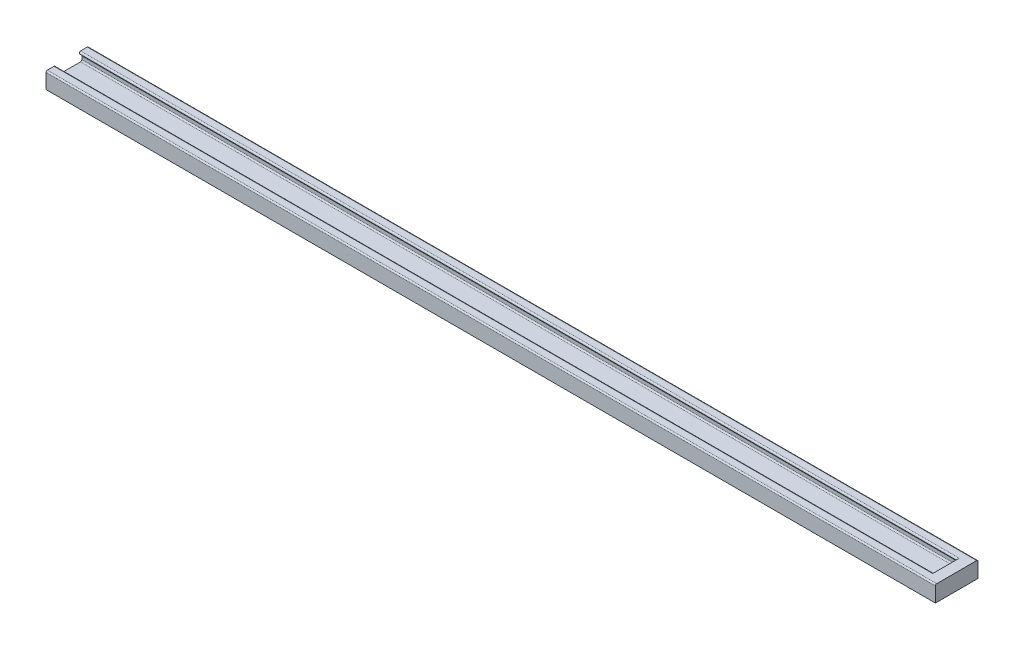
ISO-10303-21;
HEADER;
FILE_DESCRIPTION(('STEP AP214'),'2;1');
FILE_NAME('part.step','',(''),(''),'','','');
FILE_SCHEMA(('AUTOMOTIVE_DESIGN { 1 0 10303 214 1 1 1 1 }'));
ENDSEC;
DATA;
#1=APPLICATION_CONTEXT('core data for automotive mechanical design processes');
#2=APPLICATION_PROTOCOL_DEFINITION('international standard','automotive_design',2000,#1);
#3=PRODUCT_CONTEXT('',#1,'mechanical');
#4=PRODUCT('Part','Part','',(#3));
#5=PRODUCT_RELATED_PRODUCT_CATEGORY('part','',(#4));
#6=PRODUCT_DEFINITION_FORMATION('','',#4);
#7=PRODUCT_DEFINITION_CONTEXT('part definition',#1,'design');
#8=PRODUCT_DEFINITION('design','',#6,#7);
#9=PRODUCT_DEFINITION_SHAPE('','',#8);
#10=(LENGTH_UNIT() NAMED_UNIT(*) SI_UNIT(.MILLI.,.METRE.));
#11=(NAMED_UNIT(*) PLANE_ANGLE_UNIT() SI_UNIT($,.RADIAN.));
#12=(NAMED_UNIT(*) SI_UNIT($,.STERADIAN.) SOLID_ANGLE_UNIT());
#13=UNCERTAINTY_MEASURE_WITH_UNIT(LENGTH_MEASURE(1.E-05),#10,'distance_accuracy_value','');
#14=(GEOMETRIC_REPRESENTATION_CONTEXT(3) GLOBAL_UNCERTAINTY_ASSIGNED_CONTEXT((#13)) GLOBAL_UNIT_ASSIGNED_CONTEXT((#10,
#11,#12)) REPRESENTATION_CONTEXT('',''));
#15=CARTESIAN_POINT('',(0.,0.,0.));
#16=DIRECTION('',(0.,0.,1.));
#17=DIRECTION('',(1.,0.,0.));
#18=AXIS2_PLACEMENT_3D('',#15,#16,#17);
#19=CARTESIAN_POINT('',(330.,5.5,-4.95710678118656));
#20=DIRECTION('',(-1.,0.,0.));
#21=DIRECTION('',(0.,0.,1.));
#22=AXIS2_PLACEMENT_3D('',#19,#20,#21);
#23=CYLINDRICAL_SURFACE('',#22,0.499999999999999);
#24=CARTESIAN_POINT('',(326.,5.5,-4.95710678118656));
#25=DIRECTION('',(1.,0.,0.));
#26=DIRECTION('',(0.,0.,-1.));
#27=AXIS2_PLACEMENT_3D('',#24,#25,#26);
#28=CIRCLE('',#27,0.499999999999999);
#29=CARTESIAN_POINT('',(326.,6.,-4.95710678118656));
#30=VERTEX_POINT('',#29);
#31=CARTESIAN_POINT('',(326.,5.14644660940673,-4.60355339059328));
#32=VERTEX_POINT('',#31);
#33=EDGE_CURVE('E160',#30,#32,#28,.T.);
#34=ORIENTED_EDGE('',*,*,#33,.F.);
#35=DIRECTION('',(-1.,0.,0.));
#36=VECTOR('',#35,1.);
#37=CARTESIAN_POINT('',(330.,6.,-4.95710678118656));
#38=LINE('',#37,#36);
#39=CARTESIAN_POINT('',(0.,6.,-4.95710678118656));
#40=VERTEX_POINT('',#39);
#41=EDGE_CURVE('E150',#30,#40,#38,.T.);
#42=ORIENTED_EDGE('',*,*,#41,.T.);
#43=CARTESIAN_POINT('',(0.,5.5,-4.95710678118656));
#44=DIRECTION('',(1.,0.,0.));
#45=DIRECTION('',(0.,0.,-1.));
#46=AXIS2_PLACEMENT_3D('',#43,#44,#45);
#47=CIRCLE('',#46,0.499999999999999);
#48=CARTESIAN_POINT('',(0.,5.14644660940673,-4.60355339059328));
#49=VERTEX_POINT('',#48);
#50=EDGE_CURVE('E169',#40,#49,#47,.T.);
#51=ORIENTED_EDGE('',*,*,#50,.T.);
#52=DIRECTION('',(-1.,0.,0.));
#53=VECTOR('',#52,1.);
#54=CARTESIAN_POINT('',(330.,5.14644660940673,-4.60355339059328));
#55=LINE('',#54,#53);
#56=EDGE_CURVE('E229',#32,#49,#55,.T.);
#57=ORIENTED_EDGE('',*,*,#56,.F.);
#58=EDGE_LOOP('',(#34,#42,#51,#57));
#59=FACE_BOUND('',#58,.T.);
#60=ADVANCED_FACE('F33',(#59),#23,.T.);
#61=CARTESIAN_POINT('',(330.,4.49644660940672,-5.25355339059328));
#62=DIRECTION('',(0.,0.707106781186543,-0.707106781186552));
#63=DIRECTION('',(0.,0.707106781186552,0.707106781186543));
#64=AXIS2_PLACEMENT_3D('',#61,#62,#63);
#65=PLANE('',#64);
#66=DIRECTION('',(0.,-0.707106781186552,-0.707106781186543));
#67=VECTOR('',#66,1.);
#68=CARTESIAN_POINT('',(326.,4.49644660940672,-5.25355339059328));
#69=LINE('',#68,#67);
#70=CARTESIAN_POINT('',(326.,4.49644660940672,-5.25355339059328));
#71=VERTEX_POINT('',#70);
#72=EDGE_CURVE('E258',#32,#71,#69,.T.);
#73=ORIENTED_EDGE('',*,*,#72,.F.);
#74=ORIENTED_EDGE('',*,*,#56,.T.);
#75=DIRECTION('',(0.,-0.707106781186552,-0.707106781186543));
#76=VECTOR('',#75,1.);
#77=CARTESIAN_POINT('',(0.,4.49644660940672,-5.25355339059328));
#78=LINE('',#77,#76);
#79=CARTESIAN_POINT('',(0.,4.49644660940672,-5.25355339059328));
#80=VERTEX_POINT('',#79);
#81=EDGE_CURVE('E172',#49,#80,#78,.T.);
#82=ORIENTED_EDGE('',*,*,#81,.T.);
#83=DIRECTION('',(-1.,0.,0.));
#84=VECTOR('',#83,1.);
#85=CARTESIAN_POINT('',(330.,4.49644660940672,-5.25355339059328));
#86=LINE('',#85,#84);
#87=EDGE_CURVE('E227',#71,#80,#86,.T.);
#88=ORIENTED_EDGE('',*,*,#87,.F.);
#89=EDGE_LOOP('',(#73,#74,#82,#88));
#90=FACE_BOUND('',#89,.T.);
#91=ADVANCED_FACE('F279',(#90),#65,.F.);
#92=CARTESIAN_POINT('',(330.,4.14289321881345,-4.9));
#93=DIRECTION('',(-1.,0.,0.));
#94=DIRECTION('',(0.,0.,1.));
#95=AXIS2_PLACEMENT_3D('',#92,#93,#94);
#96=CYLINDRICAL_SURFACE('',#95,0.500000000000001);
#97=CARTESIAN_POINT('',(326.,4.14289321881345,-4.9));
#98=DIRECTION('',(1.,0.,0.));
#99=DIRECTION('',(0.,0.,-1.));
#100=AXIS2_PLACEMENT_3D('',#97,#98,#99);
#101=CIRCLE('',#100,0.500000000000001);
#102=CARTESIAN_POINT('',(326.,4.14289321881345,-5.4));
#103=VERTEX_POINT('',#102);
#104=EDGE_CURVE('E260',#71,#103,#101,.F.);
#105=ORIENTED_EDGE('',*,*,#104,.F.);
#106=ORIENTED_EDGE('',*,*,#87,.T.);
#107=CARTESIAN_POINT('',(0.,4.14289321881345,-4.9));
#108=DIRECTION('',(-1.,0.,0.));
#109=DIRECTION('',(0.,0.,-1.));
#110=AXIS2_PLACEMENT_3D('',#107,#108,#109);
#111=CIRCLE('',#110,0.500000000000001);
#112=CARTESIAN_POINT('',(0.,4.14289321881345,-5.4));
#113=VERTEX_POINT('',#112);
#114=EDGE_CURVE('E175',#80,#113,#111,.T.);
#115=ORIENTED_EDGE('',*,*,#114,.T.);
#116=DIRECTION('',(-1.,0.,0.));
#117=VECTOR('',#116,1.);
#118=CARTESIAN_POINT('',(330.,4.14289321881345,-5.4));
#119=LINE('',#118,#117);
#120=EDGE_CURVE('E225',#103,#113,#119,.T.);
#121=ORIENTED_EDGE('',*,*,#120,.F.);
#122=EDGE_LOOP('',(#105,#106,#115,#121));
#123=FACE_BOUND('',#122,.T.);
#124=ADVANCED_FACE('F284',(#123),#96,.F.);
#125=CARTESIAN_POINT('',(330.,3.,-5.4));
#126=DIRECTION('',(0.,0.,-1.));
#127=DIRECTION('',(0.,1.,0.));
#128=AXIS2_PLACEMENT_3D('',#125,#126,#127);
#129=PLANE('',#128);
#130=DIRECTION('',(0.,-1.,0.));
#131=VECTOR('',#130,1.);
#132=CARTESIAN_POINT('',(326.,3.,-5.4));
#133=LINE('',#132,#131);
#134=CARTESIAN_POINT('',(326.,3.,-5.4));
#135=VERTEX_POINT('',#134);
#136=EDGE_CURVE('E345',#103,#135,#133,.T.);
#137=ORIENTED_EDGE('',*,*,#136,.F.);
#138=ORIENTED_EDGE('',*,*,#120,.T.);
#139=DIRECTION('',(0.,-1.,0.));
#140=VECTOR('',#139,1.);
#141=CARTESIAN_POINT('',(0.,3.,-5.4));
#142=LINE('',#141,#140);
#143=CARTESIAN_POINT('',(0.,3.,-5.4));
#144=VERTEX_POINT('',#143);
#145=EDGE_CURVE('E178',#113,#144,#142,.T.);
#146=ORIENTED_EDGE('',*,*,#145,.T.);
#147=DIRECTION('',(-1.,0.,0.));
#148=VECTOR('',#147,1.);
#149=CARTESIAN_POINT('',(330.,3.,-5.4));
#150=LINE('',#149,#148);
#151=EDGE_CURVE('E223',#135,#144,#150,.T.);
#152=ORIENTED_EDGE('',*,*,#151,.F.);
#153=EDGE_LOOP('',(#137,#138,#146,#152));
#154=FACE_BOUND('',#153,.T.);
#155=ADVANCED_FACE('F329',(#154),#129,.F.);
#156=CARTESIAN_POINT('',(330.,3.,-4.9));
#157=DIRECTION('',(-1.,0.,0.));
#158=DIRECTION('',(0.,0.,1.));
#159=AXIS2_PLACEMENT_3D('',#156,#157,#158);
#160=CYLINDRICAL_SURFACE('',#159,0.5);
#161=CARTESIAN_POINT('',(326.,3.,-4.9));
#162=DIRECTION('',(1.,0.,0.));
#163=DIRECTION('',(0.,0.,-1.));
#164=AXIS2_PLACEMENT_3D('',#161,#162,#163);
#165=CIRCLE('',#164,0.5);
#166=CARTESIAN_POINT('',(326.,2.5,-4.9));
#167=VERTEX_POINT('',#166);
#168=EDGE_CURVE('E355',#135,#167,#165,.F.);
#169=ORIENTED_EDGE('',*,*,#168,.F.);
#170=ORIENTED_EDGE('',*,*,#151,.T.);
#171=CARTESIAN_POINT('',(0.,3.,-4.9));
#172=DIRECTION('',(-1.,0.,0.));
#173=DIRECTION('',(0.,0.,-1.));
#174=AXIS2_PLACEMENT_3D('',#171,#172,#173);
#175=CIRCLE('',#174,0.5);
#176=CARTESIAN_POINT('',(0.,2.5,-4.9));
#177=VERTEX_POINT('',#176);
#178=EDGE_CURVE('E181',#144,#177,#175,.T.);
#179=ORIENTED_EDGE('',*,*,#178,.T.);
#180=DIRECTION('',(-1.,0.,0.));
#181=VECTOR('',#180,1.);
#182=CARTESIAN_POINT('',(330.,2.5,-4.9));
#183=LINE('',#182,#181);
#184=EDGE_CURVE('E221',#167,#177,#183,.T.);
#185=ORIENTED_EDGE('',*,*,#184,.F.);
#186=EDGE_LOOP('',(#169,#170,#179,#185));
#187=FACE_BOUND('',#186,.T.);
#188=ADVANCED_FACE('F325',(#187),#160,.F.);
#189=CARTESIAN_POINT('',(330.,2.5,-4.9));
#190=DIRECTION('',(0.,-1.,0.));
#191=DIRECTION('',(0.,0.,-1.));
#192=AXIS2_PLACEMENT_3D('',#189,#190,#191);
#193=PLANE('',#192);
#194=DIRECTION('',(0.,0.,1.));
#195=VECTOR('',#194,1.);
#196=CARTESIAN_POINT('',(326.,2.5,-4.9));
#197=LINE('',#196,#195);
#198=CARTESIAN_POINT('',(326.,2.5,4.9));
#199=VERTEX_POINT('',#198);
#200=EDGE_CURVE('E357',#167,#199,#197,.T.);
#201=ORIENTED_EDGE('',*,*,#200,.F.);
#202=ORIENTED_EDGE('',*,*,#184,.T.);
#203=DIRECTION('',(0.,0.,1.));
#204=VECTOR('',#203,1.);
#205=CARTESIAN_POINT('',(0.,2.5,-4.9));
#206=LINE('',#205,#204);
#207=CARTESIAN_POINT('',(0.,2.5,4.9));
#208=VERTEX_POINT('',#207);
#209=EDGE_CURVE('E184',#177,#208,#206,.T.);
#210=ORIENTED_EDGE('',*,*,#209,.T.);
#211=DIRECTION('',(-1.,0.,0.));
#212=VECTOR('',#211,1.);
#213=CARTESIAN_POINT('',(330.,2.5,4.9));
#214=LINE('',#213,#212);
#215=EDGE_CURVE('E219',#199,#208,#214,.T.);
#216=ORIENTED_EDGE('',*,*,#215,.F.);
#217=EDGE_LOOP('',(#201,#202,#210,#216));
#218=FACE_BOUND('',#217,.T.);
#219=ADVANCED_FACE('F321',(#218),#193,.F.);
#220=CARTESIAN_POINT('',(330.,3.,4.9));
#221=DIRECTION('',(-1.,0.,0.));
#222=DIRECTION('',(0.,0.,1.));
#223=AXIS2_PLACEMENT_3D('',#220,#221,#222);
#224=CYLINDRICAL_SURFACE('',#223,0.5);
#225=CARTESIAN_POINT('',(326.,3.,4.9));
#226=DIRECTION('',(1.,0.,0.));
#227=DIRECTION('',(0.,0.,-1.));
#228=AXIS2_PLACEMENT_3D('',#225,#226,#227);
#229=CIRCLE('',#228,0.5);
#230=CARTESIAN_POINT('',(326.,3.,5.4));
#231=VERTEX_POINT('',#230);
#232=EDGE_CURVE('E362',#199,#231,#229,.F.);
#233=ORIENTED_EDGE('',*,*,#232,.F.);
#234=ORIENTED_EDGE('',*,*,#215,.T.);
#235=CARTESIAN_POINT('',(0.,3.,4.9));
#236=DIRECTION('',(-1.,0.,0.));
#237=DIRECTION('',(0.,0.,1.));
#238=AXIS2_PLACEMENT_3D('',#235,#236,#237);
#239=CIRCLE('',#238,0.5);
#240=CARTESIAN_POINT('',(0.,3.,5.4));
#241=VERTEX_POINT('',#240);
#242=EDGE_CURVE('E187',#208,#241,#239,.T.);
#243=ORIENTED_EDGE('',*,*,#242,.T.);
#244=DIRECTION('',(-1.,0.,0.));
#245=VECTOR('',#244,1.);
#246=CARTESIAN_POINT('',(330.,3.,5.4));
#247=LINE('',#246,#245);
#248=EDGE_CURVE('E217',#231,#241,#247,.T.);
#249=ORIENTED_EDGE('',*,*,#248,.F.);
#250=EDGE_LOOP('',(#233,#234,#243,#249));
#251=FACE_BOUND('',#250,.T.);
#252=ADVANCED_FACE('F317',(#251),#224,.F.);
#253=CARTESIAN_POINT('',(330.,3.,5.4));
#254=DIRECTION('',(0.,0.,1.));
#255=DIRECTION('',(0.,-1.,0.));
#256=AXIS2_PLACEMENT_3D('',#253,#254,#255);
#257=PLANE('',#256);
#258=DIRECTION('',(0.,1.,0.));
#259=VECTOR('',#258,1.);
#260=CARTESIAN_POINT('',(326.,3.,5.4));
#261=LINE('',#260,#259);
#262=CARTESIAN_POINT('',(326.,4.14289321881345,5.4));
#263=VERTEX_POINT('',#262);
#264=EDGE_CURVE('E365',#231,#263,#261,.T.);
#265=ORIENTED_EDGE('',*,*,#264,.F.);
#266=ORIENTED_EDGE('',*,*,#248,.T.);
#267=DIRECTION('',(0.,1.,0.));
#268=VECTOR('',#267,1.);
#269=CARTESIAN_POINT('',(0.,3.,5.4));
#270=LINE('',#269,#268);
#271=CARTESIAN_POINT('',(0.,4.14289321881345,5.4));
#272=VERTEX_POINT('',#271);
#273=EDGE_CURVE('E190',#241,#272,#270,.T.);
#274=ORIENTED_EDGE('',*,*,#273,.T.);
#275=DIRECTION('',(-1.,0.,0.));
#276=VECTOR('',#275,1.);
#277=CARTESIAN_POINT('',(330.,4.14289321881345,5.4));
#278=LINE('',#277,#276);
#279=EDGE_CURVE('E215',#263,#272,#278,.T.);
#280=ORIENTED_EDGE('',*,*,#279,.F.);
#281=EDGE_LOOP('',(#265,#266,#274,#280));
#282=FACE_BOUND('',#281,.T.);
#283=ADVANCED_FACE('F313',(#282),#257,.F.);
#284=CARTESIAN_POINT('',(330.,4.14289321881345,4.9));
#285=DIRECTION('',(-1.,0.,0.));
#286=DIRECTION('',(0.,0.,1.));
#287=AXIS2_PLACEMENT_3D('',#284,#285,#286);
#288=CYLINDRICAL_SURFACE('',#287,0.5);
#289=CARTESIAN_POINT('',(326.,4.14289321881345,4.9));
#290=DIRECTION('',(1.,0.,0.));
#291=DIRECTION('',(0.,0.,-1.));
#292=AXIS2_PLACEMENT_3D('',#289,#290,#291);
#293=CIRCLE('',#292,0.5);
#294=CARTESIAN_POINT('',(326.,4.49644660940672,5.25355339059328));
#295=VERTEX_POINT('',#294);
#296=EDGE_CURVE('E368',#263,#295,#293,.F.);
#297=ORIENTED_EDGE('',*,*,#296,.F.);
#298=ORIENTED_EDGE('',*,*,#279,.T.);
#299=CARTESIAN_POINT('',(0.,4.14289321881345,4.9));
#300=DIRECTION('',(-1.,0.,0.));
#301=DIRECTION('',(0.,0.,1.));
#302=AXIS2_PLACEMENT_3D('',#299,#300,#301);
#303=CIRCLE('',#302,0.5);
#304=CARTESIAN_POINT('',(0.,4.49644660940672,5.25355339059328));
#305=VERTEX_POINT('',#304);
#306=EDGE_CURVE('E193',#272,#305,#303,.T.);
#307=ORIENTED_EDGE('',*,*,#306,.T.);
#308=DIRECTION('',(-1.,0.,0.));
#309=VECTOR('',#308,1.);
#310=CARTESIAN_POINT('',(330.,4.49644660940672,5.25355339059328));
#311=LINE('',#310,#309);
#312=EDGE_CURVE('E213',#295,#305,#311,.T.);
#313=ORIENTED_EDGE('',*,*,#312,.F.);
#314=EDGE_LOOP('',(#297,#298,#307,#313));
#315=FACE_BOUND('',#314,.T.);
#316=ADVANCED_FACE('F306',(#315),#288,.F.);
#317=CARTESIAN_POINT('',(330.,4.49644660940672,5.25355339059328));
#318=DIRECTION('',(0.,0.707106781186543,0.707106781186552));
#319=DIRECTION('',(0.,-0.707106781186552,0.707106781186543));
#320=AXIS2_PLACEMENT_3D('',#317,#318,#319);
#321=PLANE('',#320);
#322=DIRECTION('',(0.,0.707106781186552,-0.707106781186543));
#323=VECTOR('',#322,1.);
#324=CARTESIAN_POINT('',(326.,4.49644660940672,5.25355339059328));
#325=LINE('',#324,#323);
#326=CARTESIAN_POINT('',(326.,5.14644660940673,4.60355339059328));
#327=VERTEX_POINT('',#326);
#328=EDGE_CURVE('E371',#295,#327,#325,.T.);
#329=ORIENTED_EDGE('',*,*,#328,.F.);
#330=ORIENTED_EDGE('',*,*,#312,.T.);
#331=DIRECTION('',(0.,0.707106781186552,-0.707106781186543));
#332=VECTOR('',#331,1.);
#333=CARTESIAN_POINT('',(0.,4.49644660940672,5.25355339059328));
#334=LINE('',#333,#332);
#335=CARTESIAN_POINT('',(0.,5.14644660940673,4.60355339059328));
#336=VERTEX_POINT('',#335);
#337=EDGE_CURVE('E196',#305,#336,#334,.T.);
#338=ORIENTED_EDGE('',*,*,#337,.T.);
#339=DIRECTION('',(-1.,0.,0.));
#340=VECTOR('',#339,1.);
#341=CARTESIAN_POINT('',(330.,5.14644660940673,4.60355339059328));
#342=LINE('',#341,#340);
#343=EDGE_CURVE('E211',#327,#336,#342,.T.);
#344=ORIENTED_EDGE('',*,*,#343,.F.);
#345=EDGE_LOOP('',(#329,#330,#338,#344));
#346=FACE_BOUND('',#345,.T.);
#347=ADVANCED_FACE('F300',(#346),#321,.F.);
#348=CARTESIAN_POINT('',(330.,5.5,4.95710678118656));
#349=DIRECTION('',(-1.,0.,0.));
#350=DIRECTION('',(0.,0.,1.));
#351=AXIS2_PLACEMENT_3D('',#348,#349,#350);
#352=CYLINDRICAL_SURFACE('',#351,0.499999999999999);
#353=CARTESIAN_POINT('',(326.,5.5,4.95710678118656));
#354=DIRECTION('',(1.,0.,0.));
#355=DIRECTION('',(0.,0.,-1.));
#356=AXIS2_PLACEMENT_3D('',#353,#354,#355);
#357=CIRCLE('',#356,0.499999999999999);
#358=CARTESIAN_POINT('',(326.,5.99999999999999,4.95710678118656));
#359=VERTEX_POINT('',#358);
#360=EDGE_CURVE('E374',#327,#359,#357,.T.);
#361=ORIENTED_EDGE('',*,*,#360,.F.);
#362=ORIENTED_EDGE('',*,*,#343,.T.);
#363=CARTESIAN_POINT('',(0.,5.5,4.95710678118656));
#364=DIRECTION('',(1.,0.,0.));
#365=DIRECTION('',(0.,0.,1.));
#366=AXIS2_PLACEMENT_3D('',#363,#364,#365);
#367=CIRCLE('',#366,0.499999999999999);
#368=CARTESIAN_POINT('',(0.,6.,4.95710678118656));
#369=VERTEX_POINT('',#368);
#370=EDGE_CURVE('E199',#336,#369,#367,.T.);
#371=ORIENTED_EDGE('',*,*,#370,.T.);
#372=DIRECTION('',(-1.,0.,0.));
#373=VECTOR('',#372,1.);
#374=CARTESIAN_POINT('',(330.,6.,4.95710678118656));
#375=LINE('',#374,#373);
#376=EDGE_CURVE('E209',#359,#369,#375,.T.);
#377=ORIENTED_EDGE('',*,*,#376,.F.);
#378=EDGE_LOOP('',(#361,#362,#371,#377));
#379=FACE_BOUND('',#378,.T.);
#380=ADVANCED_FACE('F296',(#379),#352,.T.);
#381=CARTESIAN_POINT('',(330.,5.5,7.9));
#382=DIRECTION('',(0.,0.,-1.));
#383=DIRECTION('',(-1.,0.,0.));
#384=AXIS2_PLACEMENT_3D('',#381,#382,#383);
#385=PLANE('',#384);
#386=DIRECTION('',(-1.,0.,0.));
#387=VECTOR('',#386,1.);
#388=CARTESIAN_POINT('',(330.,5.5,7.9));
#389=LINE('',#388,#387);
#390=CARTESIAN_POINT('',(330.,5.5,7.9));
#391=VERTEX_POINT('',#390);
#392=CARTESIAN_POINT('',(0.,5.5,7.9));
#393=VERTEX_POINT('',#392);
#394=EDGE_CURVE('E115',#391,#393,#389,.T.);
#395=ORIENTED_EDGE('',*,*,#394,.T.);
#396=DIRECTION('',(0.,-1.,0.));
#397=VECTOR('',#396,1.);
#398=CARTESIAN_POINT('',(0.,5.5,7.9));
#399=LINE('',#398,#397);
#400=CARTESIAN_POINT('',(0.,0.,7.9));
#401=VERTEX_POINT('',#400);
#402=EDGE_CURVE('E157',#393,#401,#399,.T.);
#403=ORIENTED_EDGE('',*,*,#402,.T.);
#404=DIRECTION('',(-1.,0.,0.));
#405=VECTOR('',#404,1.);
#406=CARTESIAN_POINT('',(330.,0.,7.9));
#407=LINE('',#406,#405);
#408=CARTESIAN_POINT('',(330.,0.,7.9));
#409=VERTEX_POINT('',#408);
#410=EDGE_CURVE('E11',#409,#401,#407,.T.);
#411=ORIENTED_EDGE('',*,*,#410,.F.);
#412=DIRECTION('',(0.,-1.,0.));
#413=VECTOR('',#412,1.);
#414=CARTESIAN_POINT('',(330.,5.5,7.9));
#415=LINE('',#414,#413);
#416=EDGE_CURVE('E206',#391,#409,#415,.T.);
#417=ORIENTED_EDGE('',*,*,#416,.F.);
#418=EDGE_LOOP('',(#395,#403,#411,#417));
#419=FACE_BOUND('',#418,.T.);
#420=ADVANCED_FACE('F35',(#419),#385,.F.);
#421=CARTESIAN_POINT('',(330.,0.,-7.9));
#422=DIRECTION('',(0.,1.,0.));
#423=DIRECTION('',(0.,0.,1.));
#424=AXIS2_PLACEMENT_3D('',#421,#422,#423);
#425=PLANE('',#424);
#426=ORIENTED_EDGE('',*,*,#410,.T.);
#427=DIRECTION('',(0.,0.,-1.));
#428=VECTOR('',#427,1.);
#429=CARTESIAN_POINT('',(0.,0.,-7.9));
#430=LINE('',#429,#428);
#431=CARTESIAN_POINT('',(0.,0.,-7.9));
#432=VERTEX_POINT('',#431);
#433=EDGE_CURVE('E159',#401,#432,#430,.T.);
#434=ORIENTED_EDGE('',*,*,#433,.T.);
#435=DIRECTION('',(-1.,0.,0.));
#436=VECTOR('',#435,1.);
#437=CARTESIAN_POINT('',(330.,0.,-7.9));
#438=LINE('',#437,#436);
#439=CARTESIAN_POINT('',(330.,0.,-7.9));
#440=VERTEX_POINT('',#439);
#441=EDGE_CURVE('E42',#440,#432,#438,.T.);
#442=ORIENTED_EDGE('',*,*,#441,.F.);
#443=DIRECTION('',(0.,0.,-1.));
#444=VECTOR('',#443,1.);
#445=CARTESIAN_POINT('',(330.,0.,-7.9));
#446=LINE('',#445,#444);
#447=EDGE_CURVE('E122',#409,#440,#446,.T.);
#448=ORIENTED_EDGE('',*,*,#447,.F.);
#449=EDGE_LOOP('',(#426,#434,#442,#448));
#450=FACE_BOUND('',#449,.T.);
#451=ADVANCED_FACE('F236',(#450),#425,.F.);
#452=CARTESIAN_POINT('',(330.,5.5,-7.9));
#453=DIRECTION('',(0.,0.,1.));
#454=DIRECTION('',(1.,0.,0.));
#455=AXIS2_PLACEMENT_3D('',#452,#453,#454);
#456=PLANE('',#455);
#457=ORIENTED_EDGE('',*,*,#441,.T.);
#458=DIRECTION('',(0.,1.,0.));
#459=VECTOR('',#458,1.);
#460=CARTESIAN_POINT('',(0.,5.5,-7.9));
#461=LINE('',#460,#459);
#462=CARTESIAN_POINT('',(0.,5.5,-7.9));
#463=VERTEX_POINT('',#462);
#464=EDGE_CURVE('E163',#432,#463,#461,.T.);
#465=ORIENTED_EDGE('',*,*,#464,.T.);
#466=DIRECTION('',(-1.,0.,0.));
#467=VECTOR('',#466,1.);
#468=CARTESIAN_POINT('',(330.,5.5,-7.9));
#469=LINE('',#468,#467);
#470=CARTESIAN_POINT('',(330.,5.5,-7.9));
#471=VERTEX_POINT('',#470);
#472=EDGE_CURVE('E149',#471,#463,#469,.T.);
#473=ORIENTED_EDGE('',*,*,#472,.F.);
#474=DIRECTION('',(0.,1.,0.));
#475=VECTOR('',#474,1.);
#476=CARTESIAN_POINT('',(330.,5.5,-7.9));
#477=LINE('',#476,#475);
#478=EDGE_CURVE('E137',#440,#471,#477,.T.);
#479=ORIENTED_EDGE('',*,*,#478,.F.);
#480=EDGE_LOOP('',(#457,#465,#473,#479));
#481=FACE_BOUND('',#480,.T.);
#482=ADVANCED_FACE('F233',(#481),#456,.F.);
#483=CARTESIAN_POINT('',(330.,5.5,-7.4));
#484=DIRECTION('',(-1.,0.,0.));
#485=DIRECTION('',(0.,0.,1.));
#486=AXIS2_PLACEMENT_3D('',#483,#484,#485);
#487=CYLINDRICAL_SURFACE('',#486,0.5);
#488=ORIENTED_EDGE('',*,*,#472,.T.);
#489=CARTESIAN_POINT('',(0.,5.5,-7.4));
#490=DIRECTION('',(1.,0.,0.));
#491=DIRECTION('',(0.,0.,-1.));
#492=AXIS2_PLACEMENT_3D('',#489,#490,#491);
#493=CIRCLE('',#492,0.5);
#494=CARTESIAN_POINT('',(0.,6.,-7.4));
#495=VERTEX_POINT('',#494);
#496=EDGE_CURVE('E145',#463,#495,#493,.T.);
#497=ORIENTED_EDGE('',*,*,#496,.T.);
#498=DIRECTION('',(-1.,0.,0.));
#499=VECTOR('',#498,1.);
#500=CARTESIAN_POINT('',(330.,6.,-7.4));
#501=LINE('',#500,#499);
#502=CARTESIAN_POINT('',(330.,6.,-7.4));
#503=VERTEX_POINT('',#502);
#504=EDGE_CURVE('E142',#503,#495,#501,.T.);
#505=ORIENTED_EDGE('',*,*,#504,.F.);
#506=CARTESIAN_POINT('',(330.,5.5,-7.4));
#507=DIRECTION('',(1.,0.,0.));
#508=DIRECTION('',(0.,0.,-1.));
#509=AXIS2_PLACEMENT_3D('',#506,#507,#508);
#510=CIRCLE('',#509,0.5);
#511=EDGE_CURVE('E131',#471,#503,#510,.T.);
#512=ORIENTED_EDGE('',*,*,#511,.F.);
#513=EDGE_LOOP('',(#488,#497,#505,#512));
#514=FACE_BOUND('',#513,.T.);
#515=ADVANCED_FACE('F143',(#514),#487,.T.);
#516=CARTESIAN_POINT('',(330.,6.,4.95710678118656));
#517=DIRECTION('',(0.,-1.,0.));
#518=DIRECTION('',(0.,0.,-1.));
#519=AXIS2_PLACEMENT_3D('',#516,#517,#518);
#520=PLANE('',#519);
#521=DIRECTION('',(-1.,0.,0.));
#522=VECTOR('',#521,1.);
#523=CARTESIAN_POINT('',(330.,6.,7.4));
#524=LINE('',#523,#522);
#525=CARTESIAN_POINT('',(330.,6.,7.4));
#526=VERTEX_POINT('',#525);
#527=CARTESIAN_POINT('',(0.,6.,7.4));
#528=VERTEX_POINT('',#527);
#529=EDGE_CURVE('E108',#526,#528,#524,.T.);
#530=ORIENTED_EDGE('',*,*,#529,.F.);
#531=DIRECTION('',(0.,0.,1.));
#532=VECTOR('',#531,1.);
#533=CARTESIAN_POINT('',(330.,6.,-4.95710678118656));
#534=LINE('',#533,#532);
#535=EDGE_CURVE('E135',#503,#526,#534,.T.);
#536=ORIENTED_EDGE('',*,*,#535,.F.);
#537=ORIENTED_EDGE('',*,*,#504,.T.);
#538=DIRECTION('',(0.,0.,1.));
#539=VECTOR('',#538,1.);
#540=CARTESIAN_POINT('',(0.,6.,-4.95710678118656));
#541=LINE('',#540,#539);
#542=EDGE_CURVE('E167',#495,#40,#541,.T.);
#543=ORIENTED_EDGE('',*,*,#542,.T.);
#544=ORIENTED_EDGE('',*,*,#41,.F.);
#545=DIRECTION('',(0.,0.,1.));
#546=VECTOR('',#545,1.);
#547=CARTESIAN_POINT('',(326.,6.,-7.4));
#548=LINE('',#547,#546);
#549=EDGE_CURVE('E248',#30,#359,#548,.T.);
#550=ORIENTED_EDGE('',*,*,#549,.T.);
#551=ORIENTED_EDGE('',*,*,#376,.T.);
#552=DIRECTION('',(0.,0.,1.));
#553=VECTOR('',#552,1.);
#554=CARTESIAN_POINT('',(0.,6.,4.95710678118656));
#555=LINE('',#554,#553);
#556=EDGE_CURVE('E202',#369,#528,#555,.T.);
#557=ORIENTED_EDGE('',*,*,#556,.T.);
#558=EDGE_LOOP('',(#530,#536,#537,#543,#544,#550,#551,#557));
#559=FACE_BOUND('',#558,.T.);
#560=ADVANCED_FACE('F152',(#559),#520,.F.);
#561=CARTESIAN_POINT('',(330.,5.5,7.4));
#562=DIRECTION('',(-1.,0.,0.));
#563=DIRECTION('',(0.,0.,1.));
#564=AXIS2_PLACEMENT_3D('',#561,#562,#563);
#565=CYLINDRICAL_SURFACE('',#564,0.5);
#566=ORIENTED_EDGE('',*,*,#529,.T.);
#567=CARTESIAN_POINT('',(0.,5.5,7.4));
#568=DIRECTION('',(1.,0.,0.));
#569=DIRECTION('',(0.,0.,1.));
#570=AXIS2_PLACEMENT_3D('',#567,#568,#569);
#571=CIRCLE('',#570,0.5);
#572=EDGE_CURVE('E204',#528,#393,#571,.T.);
#573=ORIENTED_EDGE('',*,*,#572,.T.);
#574=ORIENTED_EDGE('',*,*,#394,.F.);
#575=CARTESIAN_POINT('',(330.,5.5,7.4));
#576=DIRECTION('',(1.,0.,0.));
#577=DIRECTION('',(0.,0.,1.));
#578=AXIS2_PLACEMENT_3D('',#575,#576,#577);
#579=CIRCLE('',#578,0.5);
#580=EDGE_CURVE('E50',#526,#391,#579,.T.);
#581=ORIENTED_EDGE('',*,*,#580,.F.);
#582=EDGE_LOOP('',(#566,#573,#574,#581));
#583=FACE_BOUND('',#582,.T.);
#584=ADVANCED_FACE('F268',(#583),#565,.T.);
#585=CARTESIAN_POINT('',(330.,5.5,-7.4));
#586=DIRECTION('',(1.,0.,0.));
#587=DIRECTION('',(0.,0.,-1.));
#588=AXIS2_PLACEMENT_3D('',#585,#586,#587);
#589=PLANE('',#588);
#590=ORIENTED_EDGE('',*,*,#416,.T.);
#591=ORIENTED_EDGE('',*,*,#447,.T.);
#592=ORIENTED_EDGE('',*,*,#478,.T.);
#593=ORIENTED_EDGE('',*,*,#511,.T.);
#594=ORIENTED_EDGE('',*,*,#535,.T.);
#595=ORIENTED_EDGE('',*,*,#580,.T.);
#596=EDGE_LOOP('',(#590,#591,#592,#593,#594,#595));
#597=FACE_BOUND('',#596,.T.);
#598=ADVANCED_FACE('F133',(#597),#589,.T.);
#599=CARTESIAN_POINT('',(0.,5.5,-7.4));
#600=DIRECTION('',(1.,0.,0.));
#601=DIRECTION('',(0.,0.,-1.));
#602=AXIS2_PLACEMENT_3D('',#599,#600,#601);
#603=PLANE('',#602);
#604=ORIENTED_EDGE('',*,*,#402,.F.);
#605=ORIENTED_EDGE('',*,*,#572,.F.);
#606=ORIENTED_EDGE('',*,*,#556,.F.);
#607=ORIENTED_EDGE('',*,*,#370,.F.);
#608=ORIENTED_EDGE('',*,*,#337,.F.);
#609=ORIENTED_EDGE('',*,*,#306,.F.);
#610=ORIENTED_EDGE('',*,*,#273,.F.);
#611=ORIENTED_EDGE('',*,*,#242,.F.);
#612=ORIENTED_EDGE('',*,*,#209,.F.);
#613=ORIENTED_EDGE('',*,*,#178,.F.);
#614=ORIENTED_EDGE('',*,*,#145,.F.);
#615=ORIENTED_EDGE('',*,*,#114,.F.);
#616=ORIENTED_EDGE('',*,*,#81,.F.);
#617=ORIENTED_EDGE('',*,*,#50,.F.);
#618=ORIENTED_EDGE('',*,*,#542,.F.);
#619=ORIENTED_EDGE('',*,*,#496,.F.);
#620=ORIENTED_EDGE('',*,*,#464,.F.);
#621=ORIENTED_EDGE('',*,*,#433,.F.);
#622=EDGE_LOOP('',(#604,#605,#606,#607,#608,#609,#610,#611,#612,#613,#614,#615,#616,#617,#618,
#619,#620,#621));
#623=FACE_BOUND('',#622,.T.);
#624=ADVANCED_FACE('F240',(#623),#603,.F.);
#625=CARTESIAN_POINT('',(326.,5.5,7.4));
#626=DIRECTION('',(1.,0.,0.));
#627=DIRECTION('',(0.,0.,-1.));
#628=AXIS2_PLACEMENT_3D('',#625,#626,#627);
#629=PLANE('',#628);
#630=ORIENTED_EDGE('',*,*,#549,.F.);
#631=ORIENTED_EDGE('',*,*,#33,.T.);
#632=ORIENTED_EDGE('',*,*,#72,.T.);
#633=ORIENTED_EDGE('',*,*,#104,.T.);
#634=ORIENTED_EDGE('',*,*,#136,.T.);
#635=ORIENTED_EDGE('',*,*,#168,.T.);
#636=ORIENTED_EDGE('',*,*,#200,.T.);
#637=ORIENTED_EDGE('',*,*,#232,.T.);
#638=ORIENTED_EDGE('',*,*,#264,.T.);
#639=ORIENTED_EDGE('',*,*,#296,.T.);
#640=ORIENTED_EDGE('',*,*,#328,.T.);
#641=ORIENTED_EDGE('',*,*,#360,.T.);
#642=EDGE_LOOP('',(#630,#631,#632,#633,#634,#635,#636,#637,#638,#639,#640,#641));
#643=FACE_BOUND('',#642,.T.);
#644=ADVANCED_FACE('F377',(#643),#629,.F.);
#645=CLOSED_SHELL('',(#60,#91,#124,#155,#188,#219,#252,#283,#316,#347,#380,#420,#451,#482,#515,
#560,#584,#598,#624,#644));
#646=MANIFOLD_SOLID_BREP('B2',#645);
#647=ADVANCED_BREP_SHAPE_REPRESENTATION('',(#18,#646),#14);
#648=SHAPE_DEFINITION_REPRESENTATION(#9,#647);
ENDSEC;
END-ISO-10303-21;
